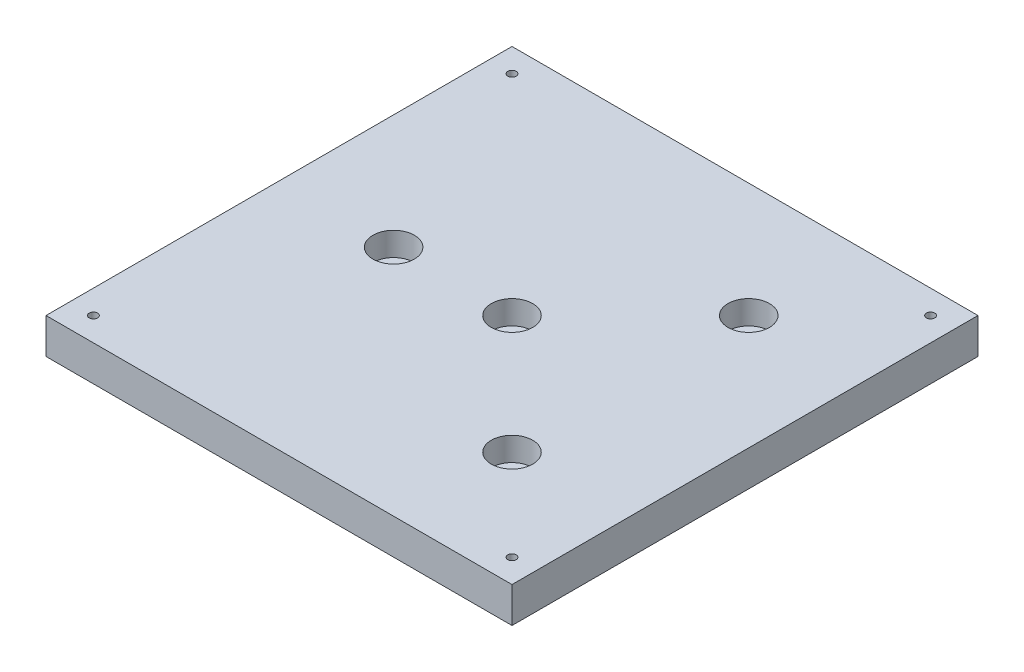
ISO-10303-21;
HEADER;
FILE_DESCRIPTION(('STEP AP214'),'2;1');
FILE_NAME('part.step','',(''),(''),'','','');
FILE_SCHEMA(('AUTOMOTIVE_DESIGN { 1 0 10303 214 1 1 1 1 }'));
ENDSEC;
DATA;
#1=APPLICATION_CONTEXT('core data for automotive mechanical design processes');
#2=APPLICATION_PROTOCOL_DEFINITION('international standard','automotive_design',2000,#1);
#3=PRODUCT_CONTEXT('',#1,'mechanical');
#4=PRODUCT('Part','Part','',(#3));
#5=PRODUCT_RELATED_PRODUCT_CATEGORY('part','',(#4));
#6=PRODUCT_DEFINITION_FORMATION('','',#4);
#7=PRODUCT_DEFINITION_CONTEXT('part definition',#1,'design');
#8=PRODUCT_DEFINITION('design','',#6,#7);
#9=PRODUCT_DEFINITION_SHAPE('','',#8);
#10=(LENGTH_UNIT() NAMED_UNIT(*) SI_UNIT(.MILLI.,.METRE.));
#11=(NAMED_UNIT(*) PLANE_ANGLE_UNIT() SI_UNIT($,.RADIAN.));
#12=(NAMED_UNIT(*) SI_UNIT($,.STERADIAN.) SOLID_ANGLE_UNIT());
#13=UNCERTAINTY_MEASURE_WITH_UNIT(LENGTH_MEASURE(1.E-05),#10,'distance_accuracy_value','');
#14=(GEOMETRIC_REPRESENTATION_CONTEXT(3) GLOBAL_UNCERTAINTY_ASSIGNED_CONTEXT((#13)) GLOBAL_UNIT_ASSIGNED_CONTEXT((#10,
#11,#12)) REPRESENTATION_CONTEXT('',''));
#15=CARTESIAN_POINT('',(0.,0.,0.));
#16=DIRECTION('',(0.,0.,1.));
#17=DIRECTION('',(1.,0.,0.));
#18=AXIS2_PLACEMENT_3D('',#15,#16,#17);
#19=CARTESIAN_POINT('',(0.,0.,0.));
#20=DIRECTION('',(0.,1.,0.));
#21=DIRECTION('',(0.,0.,1.));
#22=AXIS2_PLACEMENT_3D('',#19,#20,#21);
#23=PLANE('',#22);
#24=CARTESIAN_POINT('',(-31.75,0.,0.));
#25=DIRECTION('',(0.,1.,0.));
#26=DIRECTION('',(0.,0.,1.));
#27=AXIS2_PLACEMENT_3D('',#24,#25,#26);
#28=CIRCLE('',#27,3.3782);
#29=CARTESIAN_POINT('',(-31.75,0.,3.3782));
#30=VERTEX_POINT('',#29);
#31=EDGE_CURVE('E59',#30,#30,#28,.T.);
#32=ORIENTED_EDGE('',*,*,#31,.T.);
#33=EDGE_LOOP('',(#32));
#34=FACE_BOUND('',#33,.T.);
#35=CARTESIAN_POINT('',(31.75,0.,31.75));
#36=DIRECTION('',(0.,1.,0.));
#37=DIRECTION('',(0.,0.,1.));
#38=AXIS2_PLACEMENT_3D('',#35,#36,#37);
#39=CIRCLE('',#38,3.3782);
#40=CARTESIAN_POINT('',(31.75,0.,35.1282));
#41=VERTEX_POINT('',#40);
#42=EDGE_CURVE('E276',#41,#41,#39,.T.);
#43=ORIENTED_EDGE('',*,*,#42,.T.);
#44=EDGE_LOOP('',(#43));
#45=FACE_BOUND('',#44,.T.);
#46=CARTESIAN_POINT('',(31.75,0.,-31.75));
#47=DIRECTION('',(0.,1.,0.));
#48=DIRECTION('',(0.,0.,1.));
#49=AXIS2_PLACEMENT_3D('',#46,#47,#48);
#50=CIRCLE('',#49,3.3782);
#51=CARTESIAN_POINT('',(31.75,0.,-28.3718));
#52=VERTEX_POINT('',#51);
#53=EDGE_CURVE('E271',#52,#52,#50,.T.);
#54=ORIENTED_EDGE('',*,*,#53,.T.);
#55=EDGE_LOOP('',(#54));
#56=FACE_BOUND('',#55,.T.);
#57=CARTESIAN_POINT('',(0.,0.,0.));
#58=DIRECTION('',(0.,1.,0.));
#59=DIRECTION('',(0.,0.,1.));
#60=AXIS2_PLACEMENT_3D('',#57,#58,#59);
#61=CIRCLE('',#60,3.3782);
#62=CARTESIAN_POINT('',(0.,0.,3.3782));
#63=VERTEX_POINT('',#62);
#64=EDGE_CURVE('E266',#63,#63,#61,.T.);
#65=ORIENTED_EDGE('',*,*,#64,.T.);
#66=EDGE_LOOP('',(#65));
#67=FACE_BOUND('',#66,.T.);
#68=DIRECTION('',(-1.,0.,0.));
#69=VECTOR('',#68,1.);
#70=CARTESIAN_POINT('',(-40.64,0.,-43.65625));
#71=LINE('',#70,#69);
#72=CARTESIAN_POINT('',(-22.86,0.,-43.65625));
#73=VERTEX_POINT('',#72);
#74=CARTESIAN_POINT('',(-40.64,0.,-43.65625));
#75=VERTEX_POINT('',#74);
#76=EDGE_CURVE('E191',#73,#75,#71,.T.);
#77=ORIENTED_EDGE('',*,*,#76,.T.);
#78=DIRECTION('',(0.,0.,1.));
#79=VECTOR('',#78,1.);
#80=CARTESIAN_POINT('',(-40.64,0.,-43.65625));
#81=LINE('',#80,#79);
#82=CARTESIAN_POINT('',(-40.64,0.,-19.84375));
#83=VERTEX_POINT('',#82);
#84=EDGE_CURVE('E169',#75,#83,#81,.T.);
#85=ORIENTED_EDGE('',*,*,#84,.T.);
#86=DIRECTION('',(1.,0.,0.));
#87=VECTOR('',#86,1.);
#88=CARTESIAN_POINT('',(-40.64,0.,-19.84375));
#89=LINE('',#88,#87);
#90=CARTESIAN_POINT('',(-22.86,0.,-19.84375));
#91=VERTEX_POINT('',#90);
#92=EDGE_CURVE('E175',#83,#91,#89,.T.);
#93=ORIENTED_EDGE('',*,*,#92,.T.);
#94=DIRECTION('',(0.,0.,-1.));
#95=VECTOR('',#94,1.);
#96=CARTESIAN_POINT('',(-22.86,0.,-43.65625));
#97=LINE('',#96,#95);
#98=EDGE_CURVE('E264',#91,#73,#97,.T.);
#99=ORIENTED_EDGE('',*,*,#98,.T.);
#100=EDGE_LOOP('',(#77,#85,#93,#99));
#101=FACE_BOUND('',#100,.T.);
#102=CARTESIAN_POINT('',(-31.75,0.,31.75));
#103=DIRECTION('',(0.,1.,0.));
#104=DIRECTION('',(0.,0.,1.));
#105=AXIS2_PLACEMENT_3D('',#102,#103,#104);
#106=CIRCLE('',#105,8.89);
#107=CARTESIAN_POINT('',(-28.0103696292239,0.,23.6848115527305));
#108=VERTEX_POINT('',#107);
#109=EDGE_CURVE('E459',#108,#108,#106,.T.);
#110=ORIENTED_EDGE('',*,*,#109,.T.);
#111=EDGE_LOOP('',(#110));
#112=FACE_BOUND('',#111,.T.);
#113=CARTESIAN_POINT('',(-56.15,0.,-56.15));
#114=DIRECTION('',(0.,1.,0.));
#115=DIRECTION('',(0.,0.,1.));
#116=AXIS2_PLACEMENT_3D('',#113,#114,#115);
#117=CIRCLE('',#116,1.1303);
#118=CARTESIAN_POINT('',(-56.15,0.,-55.0197));
#119=VERTEX_POINT('',#118);
#120=EDGE_CURVE('E960',#119,#119,#117,.T.);
#121=ORIENTED_EDGE('',*,*,#120,.T.);
#122=EDGE_LOOP('',(#121));
#123=FACE_BOUND('',#122,.T.);
#124=CARTESIAN_POINT('',(56.15,0.,-56.15));
#125=DIRECTION('',(0.,1.,0.));
#126=DIRECTION('',(0.,0.,1.));
#127=AXIS2_PLACEMENT_3D('',#124,#125,#126);
#128=CIRCLE('',#127,1.1303);
#129=CARTESIAN_POINT('',(56.15,0.,-55.0197));
#130=VERTEX_POINT('',#129);
#131=EDGE_CURVE('E953',#130,#130,#128,.T.);
#132=ORIENTED_EDGE('',*,*,#131,.T.);
#133=EDGE_LOOP('',(#132));
#134=FACE_BOUND('',#133,.T.);
#135=CARTESIAN_POINT('',(-56.15,0.,56.15));
#136=DIRECTION('',(0.,1.,0.));
#137=DIRECTION('',(0.,0.,1.));
#138=AXIS2_PLACEMENT_3D('',#135,#136,#137);
#139=CIRCLE('',#138,1.1303);
#140=CARTESIAN_POINT('',(-56.15,0.,57.2803));
#141=VERTEX_POINT('',#140);
#142=EDGE_CURVE('E518',#141,#141,#139,.T.);
#143=ORIENTED_EDGE('',*,*,#142,.T.);
#144=EDGE_LOOP('',(#143));
#145=FACE_BOUND('',#144,.T.);
#146=CARTESIAN_POINT('',(56.15,0.,56.15));
#147=DIRECTION('',(0.,1.,0.));
#148=DIRECTION('',(0.,0.,1.));
#149=AXIS2_PLACEMENT_3D('',#146,#147,#148);
#150=CIRCLE('',#149,1.1303);
#151=CARTESIAN_POINT('',(56.15,0.,57.2803));
#152=VERTEX_POINT('',#151);
#153=EDGE_CURVE('E512',#152,#152,#150,.T.);
#154=ORIENTED_EDGE('',*,*,#153,.T.);
#155=EDGE_LOOP('',(#154));
#156=FACE_BOUND('',#155,.T.);
#157=DIRECTION('',(0.,0.,1.));
#158=VECTOR('',#157,1.);
#159=CARTESIAN_POINT('',(62.5,0.,0.));
#160=LINE('',#159,#158);
#161=CARTESIAN_POINT('',(62.5,0.,-62.5));
#162=VERTEX_POINT('',#161);
#163=CARTESIAN_POINT('',(62.5,0.,62.5));
#164=VERTEX_POINT('',#163);
#165=EDGE_CURVE('E522',#162,#164,#160,.T.);
#166=ORIENTED_EDGE('',*,*,#165,.T.);
#167=DIRECTION('',(1.,0.,0.));
#168=VECTOR('',#167,1.);
#169=CARTESIAN_POINT('',(0.,0.,62.5));
#170=LINE('',#169,#168);
#171=CARTESIAN_POINT('',(-62.5,0.,62.5));
#172=VERTEX_POINT('',#171);
#173=EDGE_CURVE('E534',#172,#164,#170,.T.);
#174=ORIENTED_EDGE('',*,*,#173,.F.);
#175=DIRECTION('',(0.,0.,1.));
#176=VECTOR('',#175,1.);
#177=CARTESIAN_POINT('',(-62.5,0.,0.));
#178=LINE('',#177,#176);
#179=CARTESIAN_POINT('',(-62.5,0.,-62.5));
#180=VERTEX_POINT('',#179);
#181=EDGE_CURVE('E552',#180,#172,#178,.T.);
#182=ORIENTED_EDGE('',*,*,#181,.F.);
#183=DIRECTION('',(1.,0.,0.));
#184=VECTOR('',#183,1.);
#185=CARTESIAN_POINT('',(0.,0.,-62.5));
#186=LINE('',#185,#184);
#187=EDGE_CURVE('E548',#180,#162,#186,.T.);
#188=ORIENTED_EDGE('',*,*,#187,.T.);
#189=EDGE_LOOP('',(#166,#174,#182,#188));
#190=FACE_BOUND('',#189,.T.);
#191=DIRECTION('',(0.,0.,-1.));
#192=VECTOR('',#191,1.);
#193=CARTESIAN_POINT('',(41.275,0.,-9.525));
#194=LINE('',#193,#192);
#195=CARTESIAN_POINT('',(41.275,0.,9.525));
#196=VERTEX_POINT('',#195);
#197=CARTESIAN_POINT('',(41.275,0.,-9.525));
#198=VERTEX_POINT('',#197);
#199=EDGE_CURVE('E73',#196,#198,#194,.T.);
#200=ORIENTED_EDGE('',*,*,#199,.T.);
#201=DIRECTION('',(-1.,0.,0.));
#202=VECTOR('',#201,1.);
#203=CARTESIAN_POINT('',(22.225,0.,-9.525));
#204=LINE('',#203,#202);
#205=CARTESIAN_POINT('',(22.225,0.,-9.525));
#206=VERTEX_POINT('',#205);
#207=EDGE_CURVE('E167',#198,#206,#204,.T.);
#208=ORIENTED_EDGE('',*,*,#207,.T.);
#209=DIRECTION('',(0.,0.,1.));
#210=VECTOR('',#209,1.);
#211=CARTESIAN_POINT('',(22.225,0.,-9.525));
#212=LINE('',#211,#210);
#213=CARTESIAN_POINT('',(22.225,0.,9.525));
#214=VERTEX_POINT('',#213);
#215=EDGE_CURVE('E324',#206,#214,#212,.T.);
#216=ORIENTED_EDGE('',*,*,#215,.T.);
#217=DIRECTION('',(1.,0.,0.));
#218=VECTOR('',#217,1.);
#219=CARTESIAN_POINT('',(22.225,0.,9.525));
#220=LINE('',#219,#218);
#221=EDGE_CURVE('E163',#214,#196,#220,.T.);
#222=ORIENTED_EDGE('',*,*,#221,.T.);
#223=EDGE_LOOP('',(#200,#208,#216,#222));
#224=FACE_BOUND('',#223,.T.);
#225=ADVANCED_FACE('F55',(#34,#45,#56,#67,#101,#112,#123,#134,#145,#156,#190,#224),#23,.F.);
#226=CARTESIAN_POINT('',(62.5,9.525,0.));
#227=DIRECTION('',(1.,0.,0.));
#228=DIRECTION('',(0.,0.,-1.));
#229=AXIS2_PLACEMENT_3D('',#226,#227,#228);
#230=PLANE('',#229);
#231=ORIENTED_EDGE('',*,*,#165,.F.);
#232=DIRECTION('',(0.,-1.,0.));
#233=VECTOR('',#232,1.);
#234=CARTESIAN_POINT('',(62.5,9.525,-62.5));
#235=LINE('',#234,#233);
#236=CARTESIAN_POINT('',(62.5,9.525,-62.5));
#237=VERTEX_POINT('',#236);
#238=EDGE_CURVE('E12',#237,#162,#235,.T.);
#239=ORIENTED_EDGE('',*,*,#238,.F.);
#240=DIRECTION('',(0.,0.,1.));
#241=VECTOR('',#240,1.);
#242=CARTESIAN_POINT('',(62.5,9.525,0.));
#243=LINE('',#242,#241);
#244=CARTESIAN_POINT('',(62.5,9.525,62.5));
#245=VERTEX_POINT('',#244);
#246=EDGE_CURVE('E529',#237,#245,#243,.T.);
#247=ORIENTED_EDGE('',*,*,#246,.T.);
#248=DIRECTION('',(0.,-1.,0.));
#249=VECTOR('',#248,1.);
#250=CARTESIAN_POINT('',(62.5,9.525,62.5));
#251=LINE('',#250,#249);
#252=EDGE_CURVE('E544',#245,#164,#251,.T.);
#253=ORIENTED_EDGE('',*,*,#252,.T.);
#254=EDGE_LOOP('',(#231,#239,#247,#253));
#255=FACE_BOUND('',#254,.T.);
#256=ADVANCED_FACE('F57',(#255),#230,.T.);
#257=CARTESIAN_POINT('',(0.,9.525,-62.5));
#258=DIRECTION('',(0.,0.,-1.));
#259=DIRECTION('',(-1.,0.,0.));
#260=AXIS2_PLACEMENT_3D('',#257,#258,#259);
#261=PLANE('',#260);
#262=ORIENTED_EDGE('',*,*,#187,.F.);
#263=DIRECTION('',(0.,-1.,0.));
#264=VECTOR('',#263,1.);
#265=CARTESIAN_POINT('',(-62.5,9.525,-62.5));
#266=LINE('',#265,#264);
#267=CARTESIAN_POINT('',(-62.5,9.525,-62.5));
#268=VERTEX_POINT('',#267);
#269=EDGE_CURVE('E65',#268,#180,#266,.T.);
#270=ORIENTED_EDGE('',*,*,#269,.F.);
#271=DIRECTION('',(1.,0.,0.));
#272=VECTOR('',#271,1.);
#273=CARTESIAN_POINT('',(0.,9.525,-62.5));
#274=LINE('',#273,#272);
#275=EDGE_CURVE('E533',#268,#237,#274,.T.);
#276=ORIENTED_EDGE('',*,*,#275,.T.);
#277=ORIENTED_EDGE('',*,*,#238,.T.);
#278=EDGE_LOOP('',(#262,#270,#276,#277));
#279=FACE_BOUND('',#278,.T.);
#280=ADVANCED_FACE('F347',(#279),#261,.T.);
#281=CARTESIAN_POINT('',(-62.5,9.525,0.));
#282=DIRECTION('',(1.,0.,0.));
#283=DIRECTION('',(0.,0.,-1.));
#284=AXIS2_PLACEMENT_3D('',#281,#282,#283);
#285=PLANE('',#284);
#286=ORIENTED_EDGE('',*,*,#181,.T.);
#287=DIRECTION('',(0.,-1.,0.));
#288=VECTOR('',#287,1.);
#289=CARTESIAN_POINT('',(-62.5,9.525,62.5));
#290=LINE('',#289,#288);
#291=CARTESIAN_POINT('',(-62.5,9.525,62.5));
#292=VERTEX_POINT('',#291);
#293=EDGE_CURVE('E560',#292,#172,#290,.T.);
#294=ORIENTED_EDGE('',*,*,#293,.F.);
#295=DIRECTION('',(0.,0.,1.));
#296=VECTOR('',#295,1.);
#297=CARTESIAN_POINT('',(-62.5,9.525,0.));
#298=LINE('',#297,#296);
#299=EDGE_CURVE('E538',#268,#292,#298,.T.);
#300=ORIENTED_EDGE('',*,*,#299,.F.);
#301=ORIENTED_EDGE('',*,*,#269,.T.);
#302=EDGE_LOOP('',(#286,#294,#300,#301));
#303=FACE_BOUND('',#302,.T.);
#304=ADVANCED_FACE('F568',(#303),#285,.F.);
#305=CARTESIAN_POINT('',(0.,9.525,62.5));
#306=DIRECTION('',(0.,0.,-1.));
#307=DIRECTION('',(-1.,0.,0.));
#308=AXIS2_PLACEMENT_3D('',#305,#306,#307);
#309=PLANE('',#308);
#310=ORIENTED_EDGE('',*,*,#173,.T.);
#311=ORIENTED_EDGE('',*,*,#252,.F.);
#312=DIRECTION('',(1.,0.,0.));
#313=VECTOR('',#312,1.);
#314=CARTESIAN_POINT('',(0.,9.525,62.5));
#315=LINE('',#314,#313);
#316=EDGE_CURVE('E541',#292,#245,#315,.T.);
#317=ORIENTED_EDGE('',*,*,#316,.F.);
#318=ORIENTED_EDGE('',*,*,#293,.T.);
#319=EDGE_LOOP('',(#310,#311,#317,#318));
#320=FACE_BOUND('',#319,.T.);
#321=ADVANCED_FACE('F355',(#320),#309,.F.);
#322=CARTESIAN_POINT('',(0.,9.525,0.));
#323=DIRECTION('',(0.,1.,0.));
#324=DIRECTION('',(0.,0.,1.));
#325=AXIS2_PLACEMENT_3D('',#322,#323,#324);
#326=PLANE('',#325);
#327=CARTESIAN_POINT('',(-31.75,9.525,0.));
#328=DIRECTION('',(0.,1.,0.));
#329=DIRECTION('',(0.,0.,1.));
#330=AXIS2_PLACEMENT_3D('',#327,#328,#329);
#331=CIRCLE('',#330,5.55625);
#332=CARTESIAN_POINT('',(-31.75,9.525,5.55625));
#333=VERTEX_POINT('',#332);
#334=EDGE_CURVE('E920',#333,#333,#331,.T.);
#335=ORIENTED_EDGE('',*,*,#334,.F.);
#336=EDGE_LOOP('',(#335));
#337=FACE_BOUND('',#336,.T.);
#338=CARTESIAN_POINT('',(31.75,9.525,31.75));
#339=DIRECTION('',(0.,1.,0.));
#340=DIRECTION('',(0.,0.,1.));
#341=AXIS2_PLACEMENT_3D('',#338,#339,#340);
#342=CIRCLE('',#341,5.55625);
#343=CARTESIAN_POINT('',(31.75,9.525,37.30625));
#344=VERTEX_POINT('',#343);
#345=EDGE_CURVE('E295',#344,#344,#342,.T.);
#346=ORIENTED_EDGE('',*,*,#345,.F.);
#347=EDGE_LOOP('',(#346));
#348=FACE_BOUND('',#347,.T.);
#349=CARTESIAN_POINT('',(31.75,9.525,-31.75));
#350=DIRECTION('',(0.,1.,0.));
#351=DIRECTION('',(0.,0.,1.));
#352=AXIS2_PLACEMENT_3D('',#349,#350,#351);
#353=CIRCLE('',#352,5.55625);
#354=CARTESIAN_POINT('',(31.75,9.525,-26.19375));
#355=VERTEX_POINT('',#354);
#356=EDGE_CURVE('E279',#355,#355,#353,.T.);
#357=ORIENTED_EDGE('',*,*,#356,.F.);
#358=EDGE_LOOP('',(#357));
#359=FACE_BOUND('',#358,.T.);
#360=CARTESIAN_POINT('',(0.,9.525,0.));
#361=DIRECTION('',(0.,1.,0.));
#362=DIRECTION('',(0.,0.,1.));
#363=AXIS2_PLACEMENT_3D('',#360,#361,#362);
#364=CIRCLE('',#363,5.55625);
#365=CARTESIAN_POINT('',(0.,9.525,5.55625));
#366=VERTEX_POINT('',#365);
#367=EDGE_CURVE('E274',#366,#366,#364,.T.);
#368=ORIENTED_EDGE('',*,*,#367,.F.);
#369=EDGE_LOOP('',(#368));
#370=FACE_BOUND('',#369,.T.);
#371=CARTESIAN_POINT('',(-56.15,9.525,-56.15));
#372=DIRECTION('',(0.,1.,0.));
#373=DIRECTION('',(0.,0.,1.));
#374=AXIS2_PLACEMENT_3D('',#371,#372,#373);
#375=CIRCLE('',#374,1.13029999999999);
#376=CARTESIAN_POINT('',(-56.15,9.525,-55.0197));
#377=VERTEX_POINT('',#376);
#378=EDGE_CURVE('E467',#377,#377,#375,.T.);
#379=ORIENTED_EDGE('',*,*,#378,.F.);
#380=EDGE_LOOP('',(#379));
#381=FACE_BOUND('',#380,.T.);
#382=CARTESIAN_POINT('',(56.15,9.525,-56.15));
#383=DIRECTION('',(0.,1.,0.));
#384=DIRECTION('',(0.,0.,1.));
#385=AXIS2_PLACEMENT_3D('',#382,#383,#384);
#386=CIRCLE('',#385,1.13029999999999);
#387=CARTESIAN_POINT('',(56.15,9.525,-55.0197));
#388=VERTEX_POINT('',#387);
#389=EDGE_CURVE('E948',#388,#388,#386,.T.);
#390=ORIENTED_EDGE('',*,*,#389,.F.);
#391=EDGE_LOOP('',(#390));
#392=FACE_BOUND('',#391,.T.);
#393=CARTESIAN_POINT('',(-56.15,9.525,56.15));
#394=DIRECTION('',(0.,1.,0.));
#395=DIRECTION('',(0.,0.,1.));
#396=AXIS2_PLACEMENT_3D('',#393,#394,#395);
#397=CIRCLE('',#396,1.13029999999999);
#398=CARTESIAN_POINT('',(-56.15,9.525,57.2803));
#399=VERTEX_POINT('',#398);
#400=EDGE_CURVE('E525',#399,#399,#397,.T.);
#401=ORIENTED_EDGE('',*,*,#400,.F.);
#402=EDGE_LOOP('',(#401));
#403=FACE_BOUND('',#402,.T.);
#404=CARTESIAN_POINT('',(56.15,9.525,56.15));
#405=DIRECTION('',(0.,1.,0.));
#406=DIRECTION('',(0.,0.,1.));
#407=AXIS2_PLACEMENT_3D('',#404,#405,#406);
#408=CIRCLE('',#407,1.13029999999999);
#409=CARTESIAN_POINT('',(56.15,9.525,57.2803));
#410=VERTEX_POINT('',#409);
#411=EDGE_CURVE('E515',#410,#410,#408,.T.);
#412=ORIENTED_EDGE('',*,*,#411,.F.);
#413=EDGE_LOOP('',(#412));
#414=FACE_BOUND('',#413,.T.);
#415=ORIENTED_EDGE('',*,*,#246,.F.);
#416=ORIENTED_EDGE('',*,*,#275,.F.);
#417=ORIENTED_EDGE('',*,*,#299,.T.);
#418=ORIENTED_EDGE('',*,*,#316,.T.);
#419=EDGE_LOOP('',(#415,#416,#417,#418));
#420=FACE_BOUND('',#419,.T.);
#421=ADVANCED_FACE('F353',(#337,#348,#359,#370,#381,#392,#403,#414,#420),#326,.T.);
#422=CARTESIAN_POINT('',(56.15,9.525,56.15));
#423=DIRECTION('',(0.,1.,0.));
#424=DIRECTION('',(0.,0.,1.));
#425=AXIS2_PLACEMENT_3D('',#422,#423,#424);
#426=CYLINDRICAL_SURFACE('',#425,1.13029999999999);
#427=ORIENTED_EDGE('',*,*,#153,.F.);
#428=EDGE_LOOP('',(#427));
#429=FACE_BOUND('',#428,.T.);
#430=ORIENTED_EDGE('',*,*,#411,.T.);
#431=EDGE_LOOP('',(#430));
#432=FACE_BOUND('',#431,.T.);
#433=ADVANCED_FACE('F501',(#429,#432),#426,.F.);
#434=CARTESIAN_POINT('',(-56.15,9.525,56.15));
#435=DIRECTION('',(0.,1.,0.));
#436=DIRECTION('',(0.,0.,1.));
#437=AXIS2_PLACEMENT_3D('',#434,#435,#436);
#438=CYLINDRICAL_SURFACE('',#437,1.13029999999999);
#439=ORIENTED_EDGE('',*,*,#142,.F.);
#440=EDGE_LOOP('',(#439));
#441=FACE_BOUND('',#440,.T.);
#442=ORIENTED_EDGE('',*,*,#400,.T.);
#443=EDGE_LOOP('',(#442));
#444=FACE_BOUND('',#443,.T.);
#445=ADVANCED_FACE('F498',(#441,#444),#438,.F.);
#446=CARTESIAN_POINT('',(56.15,9.525,-56.15));
#447=DIRECTION('',(0.,1.,0.));
#448=DIRECTION('',(0.,0.,1.));
#449=AXIS2_PLACEMENT_3D('',#446,#447,#448);
#450=CYLINDRICAL_SURFACE('',#449,1.13029999999999);
#451=ORIENTED_EDGE('',*,*,#131,.F.);
#452=EDGE_LOOP('',(#451));
#453=FACE_BOUND('',#452,.T.);
#454=ORIENTED_EDGE('',*,*,#389,.T.);
#455=EDGE_LOOP('',(#454));
#456=FACE_BOUND('',#455,.T.);
#457=ADVANCED_FACE('F494',(#453,#456),#450,.F.);
#458=CARTESIAN_POINT('',(-56.15,9.525,-56.15));
#459=DIRECTION('',(0.,1.,0.));
#460=DIRECTION('',(0.,0.,1.));
#461=AXIS2_PLACEMENT_3D('',#458,#459,#460);
#462=CYLINDRICAL_SURFACE('',#461,1.13029999999999);
#463=ORIENTED_EDGE('',*,*,#120,.F.);
#464=EDGE_LOOP('',(#463));
#465=FACE_BOUND('',#464,.T.);
#466=ORIENTED_EDGE('',*,*,#378,.T.);
#467=EDGE_LOOP('',(#466));
#468=FACE_BOUND('',#467,.T.);
#469=ADVANCED_FACE('F491',(#465,#468),#462,.F.);
#470=CARTESIAN_POINT('',(-31.75,6.35,31.75));
#471=DIRECTION('',(0.,-1.,0.));
#472=DIRECTION('',(0.,0.,-1.));
#473=AXIS2_PLACEMENT_3D('',#470,#471,#472);
#474=PLANE('',#473);
#475=CARTESIAN_POINT('',(-31.75,6.35,31.75));
#476=DIRECTION('',(0.,-1.,0.));
#477=DIRECTION('',(0.,0.,-1.));
#478=AXIS2_PLACEMENT_3D('',#475,#476,#477);
#479=CIRCLE('',#478,0.499999999999999);
#480=CARTESIAN_POINT('',(-31.3964466094067,6.35,31.3964466094067));
#481=VERTEX_POINT('',#480);
#482=EDGE_CURVE('E462',#481,#481,#479,.T.);
#483=ORIENTED_EDGE('',*,*,#482,.T.);
#484=EDGE_LOOP('',(#483));
#485=FACE_BOUND('',#484,.T.);
#486=ADVANCED_FACE('F482',(#485),#474,.T.);
#487=CARTESIAN_POINT('',(-28.0103696292239,0.,23.6848115527305));
#488=CARTESIAN_POINT('',(-31.3964466094067,6.35,31.3964466094067));
#489=CARTESIAN_POINT('',(-44.1407465237629,0.,16.2055508111783));
#490=CARTESIAN_POINT('',(-32.1035533905933,6.35,30.6893398282202));
#491=CARTESIAN_POINT('',(-51.6200072653151,0.,32.3359277057173));
#492=CARTESIAN_POINT('',(-32.8106601717798,6.35,31.3964466094067));
#493=CARTESIAN_POINT('',(-35.4896303707761,0.,39.8151884472695));
#494=CARTESIAN_POINT('',(-32.1035533905933,6.35,32.1035533905933));
#495=CARTESIAN_POINT('',(-19.3592534762372,0.,47.2944491888217));
#496=CARTESIAN_POINT('',(-31.3964466094067,6.35,32.8106601717798));
#497=CARTESIAN_POINT('',(-11.879992734685,0.,31.1640722942827));
#498=CARTESIAN_POINT('',(-30.6893398282202,6.35,32.1035533905933));
#499=CARTESIAN_POINT('',(-28.0103696292239,0.,23.6848115527305));
#500=CARTESIAN_POINT('',(-31.3964466094067,6.35,31.3964466094067));
#501=(BOUNDED_SURFACE() B_SPLINE_SURFACE(3,1,((#487,#488),(#489,#490),(#491,#492),(#493,#494),
(#495,#496),(#497,#498),(#499,#500)),.UNSPECIFIED.,.T.,.F.,.F.) B_SPLINE_SURFACE_WITH_KNOTS((4,
3,4),(2,2),(0.,0.5,1.),(0.,1.),
.UNSPECIFIED.) GEOMETRIC_REPRESENTATION_ITEM() RATIONAL_B_SPLINE_SURFACE(((1.,1.),
(0.333333333333333,0.333333333333333),(0.333333333333333,0.333333333333333),(1.,1.),
(0.333333333333333,0.333333333333333),(0.333333333333333,0.333333333333333),(1.,1.))) REPRESENTATION_ITEM('') SURFACE());
#502=CARTESIAN_POINT('',(-28.0103696292239,0.,23.6848115527305));
#503=CARTESIAN_POINT('',(-28.0456412644342,0.0661458333333336,23.7651410845709));
#504=CARTESIAN_POINT('',(-28.0809128996444,0.132291666666667,23.8454706164113));
#505=CARTESIAN_POINT('',(-28.1514561700649,0.264583333333333,24.006129680092));
#506=CARTESIAN_POINT('',(-28.1867278052751,0.330729166666667,24.0864592119324));
#507=CARTESIAN_POINT('',(-28.2572710756956,0.463020833333333,24.2471182756132));
#508=CARTESIAN_POINT('',(-28.2925427109058,0.529166666666666,24.3274478074535));
#509=CARTESIAN_POINT('',(-28.3630859813263,0.661458333333333,24.4881068711343));
#510=CARTESIAN_POINT('',(-28.3983576165365,0.727604166666666,24.5684364029747));
#511=CARTESIAN_POINT('',(-28.468900886957,0.859895833333333,24.7290954666554));
#512=CARTESIAN_POINT('',(-28.5041725221672,0.926041666666667,24.8094249984958));
#513=CARTESIAN_POINT('',(-28.5747157925877,1.05833333333333,24.9700840621766));
#514=CARTESIAN_POINT('',(-28.609987427798,1.12447916666667,25.0504135940169));
#515=CARTESIAN_POINT('',(-28.6805306982184,1.25677083333333,25.2110726576977));
#516=CARTESIAN_POINT('',(-28.7158023334287,1.32291666666667,25.2914021895381));
#517=CARTESIAN_POINT('',(-28.7863456038491,1.45520833333333,25.4520612532188));
#518=CARTESIAN_POINT('',(-28.8216172390594,1.52135416666667,25.5323907850592));
#519=CARTESIAN_POINT('',(-28.8921605094799,1.65364583333333,25.6930498487399));
#520=CARTESIAN_POINT('',(-28.9274321446901,1.71979166666667,25.7733793805803));
#521=CARTESIAN_POINT('',(-28.9979754151106,1.85208333333333,25.9340384442611));
#522=CARTESIAN_POINT('',(-29.0332470503208,1.91822916666667,26.0143679761015));
#523=CARTESIAN_POINT('',(-29.1037903207413,2.05052083333333,26.1750270397822));
#524=CARTESIAN_POINT('',(-29.1390619559515,2.11666666666667,26.2553565716226));
#525=CARTESIAN_POINT('',(-29.209605226372,2.24895833333333,26.4160156353033));
#526=CARTESIAN_POINT('',(-29.2448768615822,2.31510416666667,26.4963451671437));
#527=CARTESIAN_POINT('',(-29.3154201320027,2.44739583333333,26.6570042308245));
#528=CARTESIAN_POINT('',(-29.350691767213,2.51354166666667,26.7373337626648));
#529=CARTESIAN_POINT('',(-29.4212350376334,2.64583333333333,26.8979928263456));
#530=CARTESIAN_POINT('',(-29.4565066728437,2.71197916666667,26.978322358186));
#531=CARTESIAN_POINT('',(-29.5270499432641,2.84427083333333,27.1389814218667));
#532=CARTESIAN_POINT('',(-29.5623215784744,2.91041666666667,27.2193109537071));
#533=CARTESIAN_POINT('',(-29.6328648488949,3.04270833333333,27.3799700173879));
#534=CARTESIAN_POINT('',(-29.6681364841051,3.10885416666667,27.4602995492282));
#535=CARTESIAN_POINT('',(-29.7386797545256,3.24114583333333,27.620958612909));
#536=CARTESIAN_POINT('',(-29.7739513897358,3.30729166666667,27.7012881447494));
#537=CARTESIAN_POINT('',(-29.8444946601563,3.43958333333333,27.8619472084301));
#538=CARTESIAN_POINT('',(-29.8797662953665,3.50572916666667,27.9422767402705));
#539=CARTESIAN_POINT('',(-29.950309565787,3.63802083333333,28.1029358039513));
#540=CARTESIAN_POINT('',(-29.9855812009972,3.70416666666667,28.1832653357916));
#541=CARTESIAN_POINT('',(-30.0561244714177,3.83645833333333,28.3439243994724));
#542=CARTESIAN_POINT('',(-30.0913961066279,3.90260416666667,28.4242539313128));
#543=CARTESIAN_POINT('',(-30.1619393770484,4.03489583333333,28.5849129949935));
#544=CARTESIAN_POINT('',(-30.1972110122587,4.10104166666667,28.6652425268339));
#545=CARTESIAN_POINT('',(-30.2677542826791,4.23333333333333,28.8259015905146));
#546=CARTESIAN_POINT('',(-30.3030259178894,4.29947916666667,28.906231122355));
#547=CARTESIAN_POINT('',(-30.3735691883098,4.43177083333333,29.0668901860358));
#548=CARTESIAN_POINT('',(-30.4088408235201,4.49791666666667,29.1472197178762));
#549=CARTESIAN_POINT('',(-30.4793840939406,4.63020833333333,29.3078787815569));
#550=CARTESIAN_POINT('',(-30.5146557291508,4.69635416666667,29.3882083133973));
#551=CARTESIAN_POINT('',(-30.5851989995713,4.82864583333333,29.548867377078));
#552=CARTESIAN_POINT('',(-30.6204706347815,4.89479166666667,29.6291969089184));
#553=CARTESIAN_POINT('',(-30.691013905202,5.02708333333333,29.7898559725992));
#554=CARTESIAN_POINT('',(-30.7262855404122,5.09322916666667,29.8701855044396));
#555=CARTESIAN_POINT('',(-30.7968288108327,5.22552083333333,30.0308445681203));
#556=CARTESIAN_POINT('',(-30.8321004460429,5.29166666666667,30.1111740999607));
#557=CARTESIAN_POINT('',(-30.9026437164634,5.42395833333333,30.2718331636414));
#558=CARTESIAN_POINT('',(-30.9379153516736,5.49010416666667,30.3521626954818));
#559=CARTESIAN_POINT('',(-31.0084586220941,5.62239583333333,30.5128217591626));
#560=CARTESIAN_POINT('',(-31.0437302573044,5.68854166666667,30.5931512910029));
#561=CARTESIAN_POINT('',(-31.1142735277248,5.82083333333333,30.7538103546837));
#562=CARTESIAN_POINT('',(-31.1495451629351,5.88697916666667,30.8341398865241));
#563=CARTESIAN_POINT('',(-31.2200884333556,6.01927083333333,30.9947989502048));
#564=CARTESIAN_POINT('',(-31.2553600685658,6.08541666666667,31.0751284820452));
#565=CARTESIAN_POINT('',(-31.3259033389863,6.21770833333333,31.235787545726));
#566=CARTESIAN_POINT('',(-31.3611749741965,6.28385416666667,31.3161170775663));
#567=CARTESIAN_POINT('',(-31.3964466094067,6.35,31.3964466094067));
#568=B_SPLINE_CURVE_WITH_KNOTS('',3,(#502,#503,#504,#505,#506,#507,#508,#509,#510,#511,#512,
#513,#514,#515,#516,#517,#518,#519,#520,#521,#522,#523,#524,#525,#526,#527,#528,#529,#530,#531,
#532,#533,#534,#535,#536,#537,#538,#539,#540,#541,#542,#543,#544,#545,#546,#547,#548,#549,#550,
#551,#552,#553,#554,#555,#556,#557,#558,#559,#560,#561,#562,#563,#564,#565,#566,#567),
.UNSPECIFIED.,.F.,.F.,(4,2,2,2,2,2,2,2,2,2,2,2,2,2,2,2,2,2,2,2,2,2,2,2,2,2,2,2,2,2,2,2,4),(0.,
0.329620598311352,0.659241196622706,0.98886179493406,1.31848239324541,1.64810299155676,
1.97772358986812,2.30734418817947,2.63696478649082,2.96658538480218,3.29620598311353,
3.62582658142488,3.95544717973623,4.28506777804759,4.61468837635894,4.94430897467029,
5.27392957298165,5.603550171293,5.93317076960435,6.2627913679157,6.59241196622706,
6.92203256453841,7.25165316284976,7.58127376116111,7.91089435947247,8.24051495778382,
8.57013555609517,8.89975615440652,9.22937675271788,9.55899735102923,9.88861794934058,
10.2182385476519,10.5478591459633),.UNSPECIFIED.);
#569=EDGE_CURVE('BSEAM432',#108,#481,#568,.T.);
#570=ORIENTED_EDGE('',*,*,#109,.F.);
#571=ORIENTED_EDGE('',*,*,#482,.F.);
#572=ORIENTED_EDGE('',*,*,#569,.T.);
#573=ORIENTED_EDGE('',*,*,#569,.F.);
#574=EDGE_LOOP('',(#570,#572,#571,#573));
#575=FACE_BOUND('',#574,.T.);
#576=ADVANCED_FACE('F432',(#575),#501,.F.);
#577=CARTESIAN_POINT('',(0.,6.35,0.));
#578=DIRECTION('',(0.,1.,0.));
#579=DIRECTION('',(0.,0.,1.));
#580=AXIS2_PLACEMENT_3D('',#577,#578,#579);
#581=PLANE('',#580);
#582=DIRECTION('',(0.,0.,1.));
#583=VECTOR('',#582,1.);
#584=CARTESIAN_POINT('',(-31.25,6.35,-43.65625));
#585=LINE('',#584,#583);
#586=CARTESIAN_POINT('',(-31.25,6.35,-43.65625));
#587=VERTEX_POINT('',#586);
#588=CARTESIAN_POINT('',(-31.25,6.35,-19.84375));
#589=VERTEX_POINT('',#588);
#590=EDGE_CURVE('E249',#587,#589,#585,.T.);
#591=ORIENTED_EDGE('',*,*,#590,.T.);
#592=DIRECTION('',(-1.,0.,0.));
#593=VECTOR('',#592,1.);
#594=CARTESIAN_POINT('',(-32.25,6.35,-19.84375));
#595=LINE('',#594,#593);
#596=CARTESIAN_POINT('',(-32.25,6.35,-19.84375));
#597=VERTEX_POINT('',#596);
#598=EDGE_CURVE('E235',#589,#597,#595,.T.);
#599=ORIENTED_EDGE('',*,*,#598,.T.);
#600=DIRECTION('',(0.,0.,-1.));
#601=VECTOR('',#600,1.);
#602=CARTESIAN_POINT('',(-32.25,6.35,-43.65625));
#603=LINE('',#602,#601);
#604=CARTESIAN_POINT('',(-32.25,6.35,-43.65625));
#605=VERTEX_POINT('',#604);
#606=EDGE_CURVE('E400',#597,#605,#603,.T.);
#607=ORIENTED_EDGE('',*,*,#606,.T.);
#608=DIRECTION('',(1.,0.,0.));
#609=VECTOR('',#608,1.);
#610=CARTESIAN_POINT('',(-32.25,6.35,-43.65625));
#611=LINE('',#610,#609);
#612=EDGE_CURVE('E417',#605,#587,#611,.T.);
#613=ORIENTED_EDGE('',*,*,#612,.T.);
#614=EDGE_LOOP('',(#591,#599,#607,#613));
#615=FACE_BOUND('',#614,.T.);
#616=ADVANCED_FACE('F423',(#615),#581,.F.);
#617=CARTESIAN_POINT('',(0.,0.,-43.65625));
#618=DIRECTION('',(0.,0.,1.));
#619=DIRECTION('',(1.,0.,0.));
#620=AXIS2_PLACEMENT_3D('',#617,#618,#619);
#621=PLANE('',#620);
#622=DIRECTION('',(0.797369304687505,0.603491666837385,0.));
#623=VECTOR('',#622,1.);
#624=CARTESIAN_POINT('',(-40.64,0.,-43.65625));
#625=LINE('',#624,#623);
#626=EDGE_CURVE('E185',#75,#605,#625,.T.);
#627=ORIENTED_EDGE('',*,*,#626,.F.);
#628=ORIENTED_EDGE('',*,*,#76,.F.);
#629=DIRECTION('',(-0.797369304687506,0.603491666837384,0.));
#630=VECTOR('',#629,1.);
#631=CARTESIAN_POINT('',(-22.86,0.,-43.65625));
#632=LINE('',#631,#630);
#633=EDGE_CURVE('E181',#73,#587,#632,.T.);
#634=ORIENTED_EDGE('',*,*,#633,.T.);
#635=ORIENTED_EDGE('',*,*,#612,.F.);
#636=EDGE_LOOP('',(#627,#628,#634,#635));
#637=FACE_BOUND('',#636,.T.);
#638=ADVANCED_FACE('F394',(#637),#621,.T.);
#639=CARTESIAN_POINT('',(-8.32566210779787,-11.0003630054211,0.));
#640=DIRECTION('',(0.603491666837384,0.797369304687506,0.));
#641=DIRECTION('',(-0.797369304687506,0.603491666837384,0.));
#642=AXIS2_PLACEMENT_3D('',#639,#640,#641);
#643=PLANE('',#642);
#644=ORIENTED_EDGE('',*,*,#633,.F.);
#645=ORIENTED_EDGE('',*,*,#98,.F.);
#646=DIRECTION('',(-0.797369304687505,0.603491666837384,0.));
#647=VECTOR('',#646,1.);
#648=CARTESIAN_POINT('',(-22.86,0.,-19.84375));
#649=LINE('',#648,#647);
#650=EDGE_CURVE('E81',#91,#589,#649,.T.);
#651=ORIENTED_EDGE('',*,*,#650,.T.);
#652=ORIENTED_EDGE('',*,*,#590,.F.);
#653=EDGE_LOOP('',(#644,#645,#651,#652));
#654=FACE_BOUND('',#653,.T.);
#655=ADVANCED_FACE('F215',(#654),#643,.F.);
#656=CARTESIAN_POINT('',(-14.8011770805296,19.5562008985265,0.));
#657=DIRECTION('',(-0.603491666837385,0.797369304687505,0.));
#658=DIRECTION('',(-0.797369304687505,-0.603491666837385,0.));
#659=AXIS2_PLACEMENT_3D('',#656,#657,#658);
#660=PLANE('',#659);
#661=DIRECTION('',(0.797369304687505,0.603491666837385,0.));
#662=VECTOR('',#661,1.);
#663=CARTESIAN_POINT('',(-40.64,0.,-19.84375));
#664=LINE('',#663,#662);
#665=EDGE_CURVE('E184',#83,#597,#664,.T.);
#666=ORIENTED_EDGE('',*,*,#665,.F.);
#667=ORIENTED_EDGE('',*,*,#84,.F.);
#668=ORIENTED_EDGE('',*,*,#626,.T.);
#669=ORIENTED_EDGE('',*,*,#606,.F.);
#670=EDGE_LOOP('',(#666,#667,#668,#669));
#671=FACE_BOUND('',#670,.T.);
#672=ADVANCED_FACE('F204',(#671),#660,.F.);
#673=CARTESIAN_POINT('',(0.,0.,-19.84375));
#674=DIRECTION('',(0.,0.,-1.));
#675=DIRECTION('',(0.,1.,0.));
#676=AXIS2_PLACEMENT_3D('',#673,#674,#675);
#677=PLANE('',#676);
#678=ORIENTED_EDGE('',*,*,#650,.F.);
#679=ORIENTED_EDGE('',*,*,#92,.F.);
#680=ORIENTED_EDGE('',*,*,#665,.T.);
#681=ORIENTED_EDGE('',*,*,#598,.F.);
#682=EDGE_LOOP('',(#678,#679,#680,#681));
#683=FACE_BOUND('',#682,.T.);
#684=ADVANCED_FACE('F214',(#683),#677,.T.);
#685=CARTESIAN_POINT('',(41.275,4.7112,-9.525));
#686=DIRECTION('',(-1.,0.,0.));
#687=DIRECTION('',(0.,0.,1.));
#688=AXIS2_PLACEMENT_3D('',#685,#686,#687);
#689=PLANE('',#688);
#690=ORIENTED_EDGE('',*,*,#199,.F.);
#691=DIRECTION('',(0.,-1.,0.));
#692=VECTOR('',#691,1.);
#693=CARTESIAN_POINT('',(41.275,4.7112,9.525));
#694=LINE('',#693,#692);
#695=CARTESIAN_POINT('',(41.275,4.7112,9.525));
#696=VERTEX_POINT('',#695);
#697=EDGE_CURVE('E161',#696,#196,#694,.T.);
#698=ORIENTED_EDGE('',*,*,#697,.F.);
#699=DIRECTION('',(0.,0.,-1.));
#700=VECTOR('',#699,1.);
#701=CARTESIAN_POINT('',(41.275,4.7112,-9.525));
#702=LINE('',#701,#700);
#703=CARTESIAN_POINT('',(41.275,4.7112,-9.525));
#704=VERTEX_POINT('',#703);
#705=EDGE_CURVE('E152',#696,#704,#702,.T.);
#706=ORIENTED_EDGE('',*,*,#705,.T.);
#707=DIRECTION('',(0.,-1.,0.));
#708=VECTOR('',#707,1.);
#709=CARTESIAN_POINT('',(41.275,4.7112,-9.525));
#710=LINE('',#709,#708);
#711=EDGE_CURVE('E160',#704,#198,#710,.T.);
#712=ORIENTED_EDGE('',*,*,#711,.T.);
#713=EDGE_LOOP('',(#690,#698,#706,#712));
#714=FACE_BOUND('',#713,.T.);
#715=ADVANCED_FACE('F159',(#714),#689,.T.);
#716=CARTESIAN_POINT('',(22.225,4.7112,-9.525));
#717=DIRECTION('',(0.,0.,1.));
#718=DIRECTION('',(1.,0.,0.));
#719=AXIS2_PLACEMENT_3D('',#716,#717,#718);
#720=PLANE('',#719);
#721=ORIENTED_EDGE('',*,*,#207,.F.);
#722=ORIENTED_EDGE('',*,*,#711,.F.);
#723=DIRECTION('',(-1.,0.,0.));
#724=VECTOR('',#723,1.);
#725=CARTESIAN_POINT('',(22.225,4.7112,-9.525));
#726=LINE('',#725,#724);
#727=CARTESIAN_POINT('',(22.225,4.7112,-9.525));
#728=VERTEX_POINT('',#727);
#729=EDGE_CURVE('E148',#704,#728,#726,.T.);
#730=ORIENTED_EDGE('',*,*,#729,.T.);
#731=DIRECTION('',(0.,-1.,0.));
#732=VECTOR('',#731,1.);
#733=CARTESIAN_POINT('',(22.225,4.7112,-9.525));
#734=LINE('',#733,#732);
#735=EDGE_CURVE('E170',#728,#206,#734,.T.);
#736=ORIENTED_EDGE('',*,*,#735,.T.);
#737=EDGE_LOOP('',(#721,#722,#730,#736));
#738=FACE_BOUND('',#737,.T.);
#739=ADVANCED_FACE('F165',(#738),#720,.T.);
#740=CARTESIAN_POINT('',(22.225,4.7112,-9.525));
#741=DIRECTION('',(1.,0.,0.));
#742=DIRECTION('',(0.,0.,-1.));
#743=AXIS2_PLACEMENT_3D('',#740,#741,#742);
#744=PLANE('',#743);
#745=ORIENTED_EDGE('',*,*,#215,.F.);
#746=ORIENTED_EDGE('',*,*,#735,.F.);
#747=DIRECTION('',(0.,0.,1.));
#748=VECTOR('',#747,1.);
#749=CARTESIAN_POINT('',(22.225,4.7112,-9.525));
#750=LINE('',#749,#748);
#751=CARTESIAN_POINT('',(22.225,4.7112,9.525));
#752=VERTEX_POINT('',#751);
#753=EDGE_CURVE('E153',#728,#752,#750,.T.);
#754=ORIENTED_EDGE('',*,*,#753,.T.);
#755=DIRECTION('',(0.,-1.,0.));
#756=VECTOR('',#755,1.);
#757=CARTESIAN_POINT('',(22.225,4.7112,9.525));
#758=LINE('',#757,#756);
#759=EDGE_CURVE('E177',#752,#214,#758,.T.);
#760=ORIENTED_EDGE('',*,*,#759,.T.);
#761=EDGE_LOOP('',(#745,#746,#754,#760));
#762=FACE_BOUND('',#761,.T.);
#763=ADVANCED_FACE('F337',(#762),#744,.T.);
#764=CARTESIAN_POINT('',(22.225,4.7112,9.525));
#765=DIRECTION('',(0.,0.,-1.));
#766=DIRECTION('',(-1.,0.,0.));
#767=AXIS2_PLACEMENT_3D('',#764,#765,#766);
#768=PLANE('',#767);
#769=ORIENTED_EDGE('',*,*,#221,.F.);
#770=ORIENTED_EDGE('',*,*,#759,.F.);
#771=DIRECTION('',(1.,0.,0.));
#772=VECTOR('',#771,1.);
#773=CARTESIAN_POINT('',(22.225,4.7112,9.525));
#774=LINE('',#773,#772);
#775=EDGE_CURVE('E317',#752,#696,#774,.T.);
#776=ORIENTED_EDGE('',*,*,#775,.T.);
#777=ORIENTED_EDGE('',*,*,#697,.T.);
#778=EDGE_LOOP('',(#769,#770,#776,#777));
#779=FACE_BOUND('',#778,.T.);
#780=ADVANCED_FACE('F339',(#779),#768,.T.);
#781=CARTESIAN_POINT('',(0.,4.7112,0.));
#782=DIRECTION('',(0.,1.,0.));
#783=DIRECTION('',(0.,0.,1.));
#784=AXIS2_PLACEMENT_3D('',#781,#782,#783);
#785=PLANE('',#784);
#786=ORIENTED_EDGE('',*,*,#705,.F.);
#787=ORIENTED_EDGE('',*,*,#775,.F.);
#788=ORIENTED_EDGE('',*,*,#753,.F.);
#789=ORIENTED_EDGE('',*,*,#729,.F.);
#790=EDGE_LOOP('',(#786,#787,#788,#789));
#791=FACE_BOUND('',#790,.T.);
#792=ADVANCED_FACE('F150',(#791),#785,.F.);
#793=CARTESIAN_POINT('',(0.,9.525,0.));
#794=DIRECTION('',(0.,1.,0.));
#795=DIRECTION('',(0.,0.,1.));
#796=AXIS2_PLACEMENT_3D('',#793,#794,#795);
#797=CYLINDRICAL_SURFACE('',#796,3.3782);
#798=CARTESIAN_POINT('',(0.,3.175,0.));
#799=DIRECTION('',(0.,1.,0.));
#800=DIRECTION('',(0.,0.,1.));
#801=AXIS2_PLACEMENT_3D('',#798,#799,#800);
#802=CIRCLE('',#801,3.3782);
#803=CARTESIAN_POINT('',(0.,3.175,3.3782));
#804=VERTEX_POINT('',#803);
#805=EDGE_CURVE('E270',#804,#804,#802,.T.);
#806=ORIENTED_EDGE('',*,*,#805,.T.);
#807=EDGE_LOOP('',(#806));
#808=FACE_BOUND('',#807,.T.);
#809=ORIENTED_EDGE('',*,*,#64,.F.);
#810=EDGE_LOOP('',(#809));
#811=FACE_BOUND('',#810,.T.);
#812=ADVANCED_FACE('F722',(#808,#811),#797,.F.);
#813=CARTESIAN_POINT('',(3.3782,3.175,0.));
#814=DIRECTION('',(0.,-1.,0.));
#815=DIRECTION('',(0.,0.,-1.));
#816=AXIS2_PLACEMENT_3D('',#813,#814,#815);
#817=PLANE('',#816);
#818=ORIENTED_EDGE('',*,*,#805,.F.);
#819=EDGE_LOOP('',(#818));
#820=FACE_BOUND('',#819,.T.);
#821=CARTESIAN_POINT('',(0.,3.175,0.));
#822=DIRECTION('',(0.,1.,0.));
#823=DIRECTION('',(0.,0.,1.));
#824=AXIS2_PLACEMENT_3D('',#821,#822,#823);
#825=CIRCLE('',#824,5.55625);
#826=CARTESIAN_POINT('',(0.,3.175,5.55625));
#827=VERTEX_POINT('',#826);
#828=EDGE_CURVE('E308',#827,#827,#825,.T.);
#829=ORIENTED_EDGE('',*,*,#828,.T.);
#830=EDGE_LOOP('',(#829));
#831=FACE_BOUND('',#830,.T.);
#832=ADVANCED_FACE('F730',(#820,#831),#817,.F.);
#833=CARTESIAN_POINT('',(0.,9.525,0.));
#834=DIRECTION('',(0.,1.,0.));
#835=DIRECTION('',(0.,0.,1.));
#836=AXIS2_PLACEMENT_3D('',#833,#834,#835);
#837=CYLINDRICAL_SURFACE('',#836,5.55625);
#838=ORIENTED_EDGE('',*,*,#828,.F.);
#839=EDGE_LOOP('',(#838));
#840=FACE_BOUND('',#839,.T.);
#841=ORIENTED_EDGE('',*,*,#367,.T.);
#842=EDGE_LOOP('',(#841));
#843=FACE_BOUND('',#842,.T.);
#844=ADVANCED_FACE('F739',(#840,#843),#837,.F.);
#845=CARTESIAN_POINT('',(31.75,9.525,-31.75));
#846=DIRECTION('',(0.,1.,0.));
#847=DIRECTION('',(0.,0.,1.));
#848=AXIS2_PLACEMENT_3D('',#845,#846,#847);
#849=CYLINDRICAL_SURFACE('',#848,3.3782);
#850=CARTESIAN_POINT('',(31.75,3.175,-31.75));
#851=DIRECTION('',(0.,1.,0.));
#852=DIRECTION('',(0.,0.,1.));
#853=AXIS2_PLACEMENT_3D('',#850,#851,#852);
#854=CIRCLE('',#853,3.3782);
#855=CARTESIAN_POINT('',(31.75,3.175,-28.3718));
#856=VERTEX_POINT('',#855);
#857=EDGE_CURVE('E275',#856,#856,#854,.T.);
#858=ORIENTED_EDGE('',*,*,#857,.T.);
#859=EDGE_LOOP('',(#858));
#860=FACE_BOUND('',#859,.T.);
#861=ORIENTED_EDGE('',*,*,#53,.F.);
#862=EDGE_LOOP('',(#861));
#863=FACE_BOUND('',#862,.T.);
#864=ADVANCED_FACE('F748',(#860,#863),#849,.F.);
#865=CARTESIAN_POINT('',(35.1282,3.175,-31.75));
#866=DIRECTION('',(0.,-1.,0.));
#867=DIRECTION('',(0.,0.,-1.));
#868=AXIS2_PLACEMENT_3D('',#865,#866,#867);
#869=PLANE('',#868);
#870=ORIENTED_EDGE('',*,*,#857,.F.);
#871=EDGE_LOOP('',(#870));
#872=FACE_BOUND('',#871,.T.);
#873=CARTESIAN_POINT('',(31.75,3.175,-31.75));
#874=DIRECTION('',(0.,1.,0.));
#875=DIRECTION('',(0.,0.,1.));
#876=AXIS2_PLACEMENT_3D('',#873,#874,#875);
#877=CIRCLE('',#876,5.55625);
#878=CARTESIAN_POINT('',(31.75,3.175,-26.19375));
#879=VERTEX_POINT('',#878);
#880=EDGE_CURVE('E286',#879,#879,#877,.T.);
#881=ORIENTED_EDGE('',*,*,#880,.T.);
#882=EDGE_LOOP('',(#881));
#883=FACE_BOUND('',#882,.T.);
#884=ADVANCED_FACE('F757',(#872,#883),#869,.F.);
#885=CARTESIAN_POINT('',(31.75,9.525,-31.75));
#886=DIRECTION('',(0.,1.,0.));
#887=DIRECTION('',(0.,0.,1.));
#888=AXIS2_PLACEMENT_3D('',#885,#886,#887);
#889=CYLINDRICAL_SURFACE('',#888,5.55625);
#890=ORIENTED_EDGE('',*,*,#880,.F.);
#891=EDGE_LOOP('',(#890));
#892=FACE_BOUND('',#891,.T.);
#893=ORIENTED_EDGE('',*,*,#356,.T.);
#894=EDGE_LOOP('',(#893));
#895=FACE_BOUND('',#894,.T.);
#896=ADVANCED_FACE('F766',(#892,#895),#889,.F.);
#897=CARTESIAN_POINT('',(31.75,9.525,31.75));
#898=DIRECTION('',(0.,1.,0.));
#899=DIRECTION('',(0.,0.,1.));
#900=AXIS2_PLACEMENT_3D('',#897,#898,#899);
#901=CYLINDRICAL_SURFACE('',#900,3.3782);
#902=CARTESIAN_POINT('',(31.75,3.175,31.75));
#903=DIRECTION('',(0.,1.,0.));
#904=DIRECTION('',(0.,0.,1.));
#905=AXIS2_PLACEMENT_3D('',#902,#903,#904);
#906=CIRCLE('',#905,3.3782);
#907=CARTESIAN_POINT('',(31.75,3.175,35.1282));
#908=VERTEX_POINT('',#907);
#909=EDGE_CURVE('E280',#908,#908,#906,.T.);
#910=ORIENTED_EDGE('',*,*,#909,.T.);
#911=EDGE_LOOP('',(#910));
#912=FACE_BOUND('',#911,.T.);
#913=ORIENTED_EDGE('',*,*,#42,.F.);
#914=EDGE_LOOP('',(#913));
#915=FACE_BOUND('',#914,.T.);
#916=ADVANCED_FACE('F775',(#912,#915),#901,.F.);
#917=CARTESIAN_POINT('',(35.1282,3.175,31.75));
#918=DIRECTION('',(0.,-1.,0.));
#919=DIRECTION('',(0.,0.,-1.));
#920=AXIS2_PLACEMENT_3D('',#917,#918,#919);
#921=PLANE('',#920);
#922=ORIENTED_EDGE('',*,*,#909,.F.);
#923=EDGE_LOOP('',(#922));
#924=FACE_BOUND('',#923,.T.);
#925=CARTESIAN_POINT('',(31.75,3.175,31.75));
#926=DIRECTION('',(0.,1.,0.));
#927=DIRECTION('',(0.,0.,1.));
#928=AXIS2_PLACEMENT_3D('',#925,#926,#927);
#929=CIRCLE('',#928,5.55625);
#930=CARTESIAN_POINT('',(31.75,3.175,37.30625));
#931=VERTEX_POINT('',#930);
#932=EDGE_CURVE('E289',#931,#931,#929,.T.);
#933=ORIENTED_EDGE('',*,*,#932,.T.);
#934=EDGE_LOOP('',(#933));
#935=FACE_BOUND('',#934,.T.);
#936=ADVANCED_FACE('F785',(#924,#935),#921,.F.);
#937=CARTESIAN_POINT('',(31.75,9.525,31.75));
#938=DIRECTION('',(0.,1.,0.));
#939=DIRECTION('',(0.,0.,1.));
#940=AXIS2_PLACEMENT_3D('',#937,#938,#939);
#941=CYLINDRICAL_SURFACE('',#940,5.55625);
#942=ORIENTED_EDGE('',*,*,#932,.F.);
#943=EDGE_LOOP('',(#942));
#944=FACE_BOUND('',#943,.T.);
#945=ORIENTED_EDGE('',*,*,#345,.T.);
#946=EDGE_LOOP('',(#945));
#947=FACE_BOUND('',#946,.T.);
#948=ADVANCED_FACE('F793',(#944,#947),#941,.F.);
#949=CARTESIAN_POINT('',(-31.75,9.525,0.));
#950=DIRECTION('',(0.,1.,0.));
#951=DIRECTION('',(0.,0.,1.));
#952=AXIS2_PLACEMENT_3D('',#949,#950,#951);
#953=CYLINDRICAL_SURFACE('',#952,3.3782);
#954=CARTESIAN_POINT('',(-31.75,3.175,0.));
#955=DIRECTION('',(0.,1.,0.));
#956=DIRECTION('',(0.,0.,1.));
#957=AXIS2_PLACEMENT_3D('',#954,#955,#956);
#958=CIRCLE('',#957,3.3782);
#959=CARTESIAN_POINT('',(-31.75,3.175,3.3782));
#960=VERTEX_POINT('',#959);
#961=EDGE_CURVE('E924',#960,#960,#958,.T.);
#962=ORIENTED_EDGE('',*,*,#961,.T.);
#963=EDGE_LOOP('',(#962));
#964=FACE_BOUND('',#963,.T.);
#965=ORIENTED_EDGE('',*,*,#31,.F.);
#966=EDGE_LOOP('',(#965));
#967=FACE_BOUND('',#966,.T.);
#968=ADVANCED_FACE('F802',(#964,#967),#953,.F.);
#969=CARTESIAN_POINT('',(-28.3718,3.175,0.));
#970=DIRECTION('',(0.,-1.,0.));
#971=DIRECTION('',(0.,0.,-1.));
#972=AXIS2_PLACEMENT_3D('',#969,#970,#971);
#973=PLANE('',#972);
#974=ORIENTED_EDGE('',*,*,#961,.F.);
#975=EDGE_LOOP('',(#974));
#976=FACE_BOUND('',#975,.T.);
#977=CARTESIAN_POINT('',(-31.75,3.175,0.));
#978=DIRECTION('',(0.,1.,0.));
#979=DIRECTION('',(0.,0.,1.));
#980=AXIS2_PLACEMENT_3D('',#977,#978,#979);
#981=CIRCLE('',#980,5.55625);
#982=CARTESIAN_POINT('',(-31.75,3.175,5.55625));
#983=VERTEX_POINT('',#982);
#984=EDGE_CURVE('E917',#983,#983,#981,.T.);
#985=ORIENTED_EDGE('',*,*,#984,.T.);
#986=EDGE_LOOP('',(#985));
#987=FACE_BOUND('',#986,.T.);
#988=ADVANCED_FACE('F812',(#976,#987),#973,.F.);
#989=CARTESIAN_POINT('',(-31.75,9.525,0.));
#990=DIRECTION('',(0.,1.,0.));
#991=DIRECTION('',(0.,0.,1.));
#992=AXIS2_PLACEMENT_3D('',#989,#990,#991);
#993=CYLINDRICAL_SURFACE('',#992,5.55625);
#994=ORIENTED_EDGE('',*,*,#984,.F.);
#995=EDGE_LOOP('',(#994));
#996=FACE_BOUND('',#995,.T.);
#997=ORIENTED_EDGE('',*,*,#334,.T.);
#998=EDGE_LOOP('',(#997));
#999=FACE_BOUND('',#998,.T.);
#1000=ADVANCED_FACE('F821',(#996,#999),#993,.F.);
#1001=CLOSED_SHELL('',(#225,#256,#280,#304,#321,#421,#433,#445,#457,#469,#486,#576,#616,#638,
#655,#672,#684,#715,#739,#763,#780,#792,#812,#832,#844,#864,#884,#896,#916,#936,#948,#968,#988,#1000));
#1002=MANIFOLD_SOLID_BREP('B2',#1001);
#1003=ADVANCED_BREP_SHAPE_REPRESENTATION('',(#18,#1002),#14);
#1004=SHAPE_DEFINITION_REPRESENTATION(#9,#1003);
ENDSEC;
END-ISO-10303-21;
